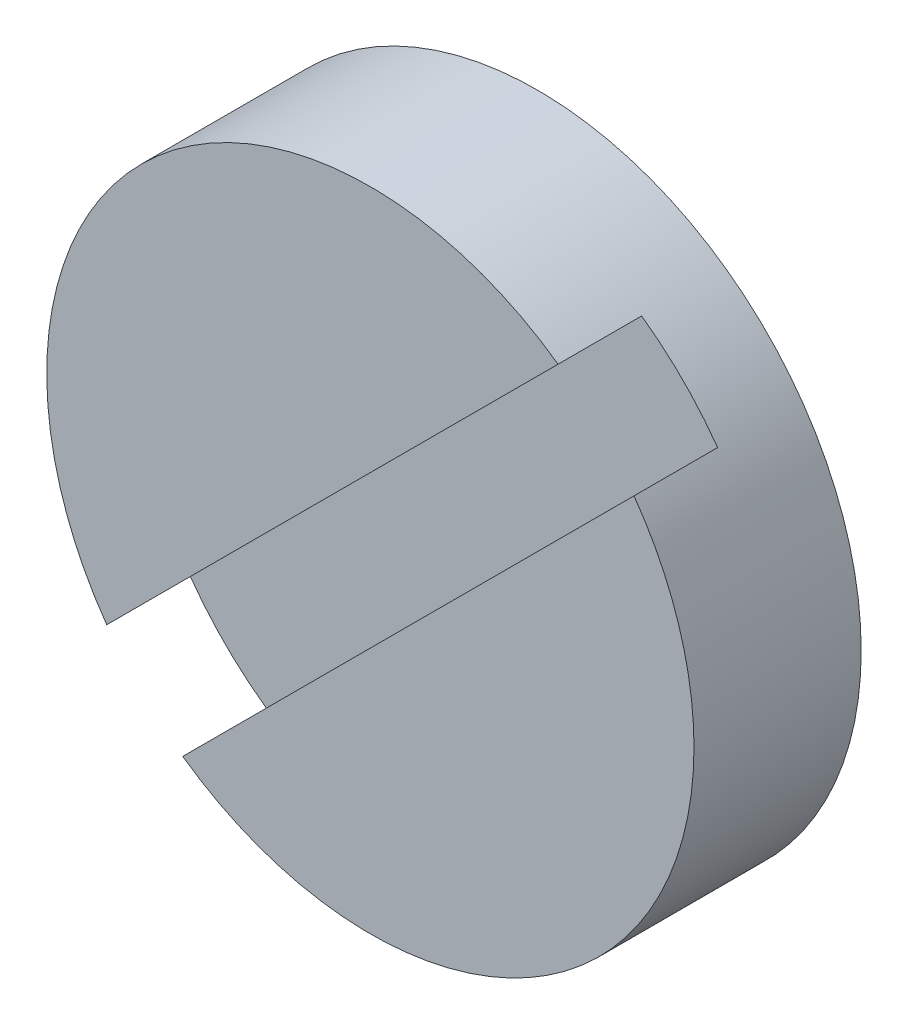
ISO-10303-21;
HEADER;
FILE_DESCRIPTION(('STEP AP214'),'2;1');
FILE_NAME('part.step','',(''),(''),'','','');
FILE_SCHEMA(('AUTOMOTIVE_DESIGN { 1 0 10303 214 1 1 1 1 }'));
ENDSEC;
DATA;
#1=APPLICATION_CONTEXT('core data for automotive mechanical design processes');
#2=APPLICATION_PROTOCOL_DEFINITION('international standard','automotive_design',2000,#1);
#3=PRODUCT_CONTEXT('',#1,'mechanical');
#4=PRODUCT('Part','Part','',(#3));
#5=PRODUCT_RELATED_PRODUCT_CATEGORY('part','',(#4));
#6=PRODUCT_DEFINITION_FORMATION('','',#4);
#7=PRODUCT_DEFINITION_CONTEXT('part definition',#1,'design');
#8=PRODUCT_DEFINITION('design','',#6,#7);
#9=PRODUCT_DEFINITION_SHAPE('','',#8);
#10=(LENGTH_UNIT() NAMED_UNIT(*) SI_UNIT(.MILLI.,.METRE.));
#11=(NAMED_UNIT(*) PLANE_ANGLE_UNIT() SI_UNIT($,.RADIAN.));
#12=(NAMED_UNIT(*) SI_UNIT($,.STERADIAN.) SOLID_ANGLE_UNIT());
#13=UNCERTAINTY_MEASURE_WITH_UNIT(LENGTH_MEASURE(1.E-05),#10,'distance_accuracy_value','');
#14=(GEOMETRIC_REPRESENTATION_CONTEXT(3) GLOBAL_UNCERTAINTY_ASSIGNED_CONTEXT((#13)) GLOBAL_UNIT_ASSIGNED_CONTEXT((#10,
#11,#12)) REPRESENTATION_CONTEXT('',''));
#15=CARTESIAN_POINT('',(0.,0.,0.));
#16=DIRECTION('',(0.,0.,1.));
#17=DIRECTION('',(1.,0.,0.));
#18=AXIS2_PLACEMENT_3D('',#15,#16,#17);
#19=CARTESIAN_POINT('',(8.45887925727502,43.2637793841127,15.6083));
#20=DIRECTION('',(-0.707106781186535,0.70710678118656,0.));
#21=DIRECTION('',(0.,0.,-1.));
#22=AXIS2_PLACEMENT_3D('',#19,#20,#21);
#23=PLANE('',#22);
#24=DIRECTION('',(0.,0.,1.));
#25=VECTOR('',#24,1.);
#26=CARTESIAN_POINT('',(3.17918024418723,37.9840803710251,15.0749));
#27=LINE('',#26,#25);
#28=CARTESIAN_POINT('',(3.17918024418716,37.9840803710251,14.6304));
#29=VERTEX_POINT('',#28);
#30=CARTESIAN_POINT('',(3.17918024418722,37.984080371025,15.5194));
#31=VERTEX_POINT('',#30);
#32=EDGE_CURVE('E79',#29,#31,#27,.T.);
#33=ORIENTED_EDGE('',*,*,#32,.T.);
#34=DIRECTION('',(-0.707106781186549,-0.707106781186547,0.));
#35=VECTOR('',#34,1.);
#36=CARTESIAN_POINT('',(5.57904343195447,40.3839435587922,15.5194));
#37=LINE('',#36,#35);
#38=CARTESIAN_POINT('',(7.9789066197216,42.7838067465593,15.5194));
#39=VERTEX_POINT('',#38);
#40=EDGE_CURVE('E81',#39,#31,#37,.T.);
#41=ORIENTED_EDGE('',*,*,#40,.F.);
#42=DIRECTION('',(0.,0.,-1.));
#43=VECTOR('',#42,1.);
#44=CARTESIAN_POINT('',(7.97890661972157,42.7838067465593,15.0749));
#45=LINE('',#44,#43);
#46=CARTESIAN_POINT('',(7.97890661972156,42.7838067465594,14.6304));
#47=VERTEX_POINT('',#46);
#48=EDGE_CURVE('E82',#39,#47,#45,.T.);
#49=ORIENTED_EDGE('',*,*,#48,.T.);
#50=DIRECTION('',(0.707106781186548,0.707106781186547,0.));
#51=VECTOR('',#50,1.);
#52=CARTESIAN_POINT('',(5.57904343195433,40.3839435587922,14.6304));
#53=LINE('',#52,#51);
#54=EDGE_CURVE('E66',#29,#47,#53,.T.);
#55=ORIENTED_EDGE('',*,*,#54,.F.);
#56=EDGE_LOOP('',(#33,#41,#49,#55));
#57=FACE_BOUND('',#56,.T.);
#58=ADVANCED_FACE('F17',(#57),#23,.T.);
#59=CARTESIAN_POINT('',(5.89766116275868,33.5409716234166,15.5194));
#60=DIRECTION('',(0.,0.,1.));
#61=DIRECTION('',(0.707106781186556,0.707106781186539,0.));
#62=AXIS2_PLACEMENT_3D('',#59,#60,#61);
#63=PLANE('',#62);
#64=ORIENTED_EDGE('',*,*,#40,.T.);
#65=CARTESIAN_POINT('',(5.17493190650629,40.7880550842403,15.5194));
#66=DIRECTION('',(0.,0.,1.));
#67=DIRECTION('',(1.,0.,0.));
#68=AXIS2_PLACEMENT_3D('',#65,#66,#67);
#69=CIRCLE('',#68,3.44170000000006);
#70=EDGE_CURVE('E67',#39,#31,#69,.F.);
#71=ORIENTED_EDGE('',*,*,#70,.F.);
#72=EDGE_LOOP('',(#64,#71));
#73=FACE_BOUND('',#72,.T.);
#74=ADVANCED_FACE('F91',(#73),#63,.T.);
#75=CARTESIAN_POINT('',(5.17493190650629,47.5175943959569,14.6304));
#76=DIRECTION('',(0.,0.,1.));
#77=DIRECTION('',(-0.707106781186547,-0.707106781186548,0.));
#78=AXIS2_PLACEMENT_3D('',#75,#76,#77);
#79=PLANE('',#78);
#80=ORIENTED_EDGE('',*,*,#54,.T.);
#81=CARTESIAN_POINT('',(5.17493190650629,40.7880550842403,14.6304));
#82=DIRECTION('',(0.,0.,1.));
#83=DIRECTION('',(1.,0.,0.));
#84=AXIS2_PLACEMENT_3D('',#81,#82,#83);
#85=CIRCLE('',#84,3.44170000000006);
#86=CARTESIAN_POINT('',(7.17068356882534,43.5920297974556,14.6304));
#87=VERTEX_POINT('',#86);
#88=EDGE_CURVE('E21',#87,#47,#85,.F.);
#89=ORIENTED_EDGE('',*,*,#88,.F.);
#90=DIRECTION('',(0.707106781186543,0.707106781186552,0.));
#91=VECTOR('',#90,1.);
#92=CARTESIAN_POINT('',(4.77082038105818,41.1921666096885,14.6304));
#93=LINE('',#92,#91);
#94=CARTESIAN_POINT('',(2.37095719329099,38.7923034219212,14.6304));
#95=VERTEX_POINT('',#94);
#96=EDGE_CURVE('E63',#95,#87,#93,.T.);
#97=ORIENTED_EDGE('',*,*,#96,.F.);
#98=CARTESIAN_POINT('',(5.17493190650629,40.7880550842403,14.6304));
#99=DIRECTION('',(0.,0.,1.));
#100=DIRECTION('',(1.,0.,0.));
#101=AXIS2_PLACEMENT_3D('',#98,#99,#100);
#102=CIRCLE('',#101,3.44170000000006);
#103=EDGE_CURVE('E56',#29,#95,#102,.F.);
#104=ORIENTED_EDGE('',*,*,#103,.F.);
#105=EDGE_LOOP('',(#80,#89,#97,#104));
#106=FACE_BOUND('',#105,.T.);
#107=ADVANCED_FACE('F62',(#106),#79,.T.);
#108=CARTESIAN_POINT('',(7.65065620637878,44.0720024350091,14.5415));
#109=DIRECTION('',(0.707106781186552,-0.707106781186543,0.));
#110=DIRECTION('',(0.,0.,1.));
#111=AXIS2_PLACEMENT_3D('',#108,#109,#110);
#112=PLANE('',#111);
#113=DIRECTION('',(0.,0.,-1.));
#114=VECTOR('',#113,1.);
#115=CARTESIAN_POINT('',(2.37095719329102,38.7923034219213,15.0749));
#116=LINE('',#115,#114);
#117=CARTESIAN_POINT('',(2.37095719329099,38.7923034219212,15.5194));
#118=VERTEX_POINT('',#117);
#119=EDGE_CURVE('E71',#118,#95,#116,.T.);
#120=ORIENTED_EDGE('',*,*,#119,.T.);
#121=ORIENTED_EDGE('',*,*,#96,.T.);
#122=DIRECTION('',(0.,0.,1.));
#123=VECTOR('',#122,1.);
#124=CARTESIAN_POINT('',(7.17068356882535,43.5920297974557,15.0749));
#125=LINE('',#124,#123);
#126=CARTESIAN_POINT('',(7.17068356882537,43.5920297974556,15.5194));
#127=VERTEX_POINT('',#126);
#128=EDGE_CURVE('E36',#87,#127,#125,.T.);
#129=ORIENTED_EDGE('',*,*,#128,.T.);
#130=DIRECTION('',(0.707106781186548,0.707106781186547,0.));
#131=VECTOR('',#130,1.);
#132=CARTESIAN_POINT('',(4.77082038105826,41.1921666096885,15.5194));
#133=LINE('',#132,#131);
#134=EDGE_CURVE('E74',#118,#127,#133,.T.);
#135=ORIENTED_EDGE('',*,*,#134,.F.);
#136=EDGE_LOOP('',(#120,#121,#129,#135));
#137=FACE_BOUND('',#136,.T.);
#138=ADVANCED_FACE('F73',(#137),#112,.T.);
#139=CARTESIAN_POINT('',(13.3830742572013,40.7880550842403,13.7414));
#140=DIRECTION('',(0.,0.,-1.));
#141=DIRECTION('',(-0.707106781186551,-0.707106781186544,0.));
#142=AXIS2_PLACEMENT_3D('',#139,#140,#141);
#143=PLANE('',#142);
#144=CARTESIAN_POINT('',(5.17493190650629,40.7880550842403,13.7414));
#145=DIRECTION('',(0.,0.,1.));
#146=DIRECTION('',(1.,0.,0.));
#147=AXIS2_PLACEMENT_3D('',#144,#145,#146);
#148=CIRCLE('',#147,3.44170000000006);
#149=CARTESIAN_POINT('',(8.61663190650635,40.7880550842403,13.7414));
#150=VERTEX_POINT('',#149);
#151=EDGE_CURVE('E27',#150,#150,#148,.T.);
#152=ORIENTED_EDGE('',*,*,#151,.F.);
#153=EDGE_LOOP('',(#152));
#154=FACE_BOUND('',#153,.T.);
#155=ADVANCED_FACE('F107',(#154),#143,.T.);
#156=CARTESIAN_POINT('',(4.45220265025393,34.9864301359213,15.5194));
#157=DIRECTION('',(0.,0.,1.));
#158=DIRECTION('',(0.707106781186542,0.707106781186553,0.));
#159=AXIS2_PLACEMENT_3D('',#156,#157,#158);
#160=PLANE('',#159);
#161=ORIENTED_EDGE('',*,*,#134,.T.);
#162=CARTESIAN_POINT('',(5.17493190650629,40.7880550842403,15.5194));
#163=DIRECTION('',(0.,0.,1.));
#164=DIRECTION('',(1.,0.,0.));
#165=AXIS2_PLACEMENT_3D('',#162,#163,#164);
#166=CIRCLE('',#165,3.44170000000006);
#167=EDGE_CURVE('E11',#118,#127,#166,.F.);
#168=ORIENTED_EDGE('',*,*,#167,.F.);
#169=EDGE_LOOP('',(#161,#168));
#170=FACE_BOUND('',#169,.T.);
#171=ADVANCED_FACE('F19',(#170),#160,.T.);
#172=CARTESIAN_POINT('',(5.17493190650629,40.7880550842403,15.5194));
#173=DIRECTION('',(0.,0.,1.));
#174=DIRECTION('',(1.,0.,0.));
#175=AXIS2_PLACEMENT_3D('',#172,#173,#174);
#176=CYLINDRICAL_SURFACE('',#175,3.44170000000006);
#177=ORIENTED_EDGE('',*,*,#128,.F.);
#178=ORIENTED_EDGE('',*,*,#88,.T.);
#179=ORIENTED_EDGE('',*,*,#48,.F.);
#180=ORIENTED_EDGE('',*,*,#70,.T.);
#181=ORIENTED_EDGE('',*,*,#32,.F.);
#182=ORIENTED_EDGE('',*,*,#103,.T.);
#183=ORIENTED_EDGE('',*,*,#119,.F.);
#184=ORIENTED_EDGE('',*,*,#167,.T.);
#185=EDGE_LOOP('',(#177,#178,#179,#180,#181,#182,#183,#184));
#186=FACE_BOUND('',#185,.T.);
#187=ORIENTED_EDGE('',*,*,#151,.T.);
#188=EDGE_LOOP('',(#187));
#189=FACE_BOUND('',#188,.T.);
#190=ADVANCED_FACE('F68',(#186,#189),#176,.T.);
#191=CLOSED_SHELL('',(#58,#74,#107,#138,#155,#171,#190));
#192=MANIFOLD_SOLID_BREP('B1',#191);
#193=ADVANCED_BREP_SHAPE_REPRESENTATION('',(#18,#192),#14);
#194=SHAPE_DEFINITION_REPRESENTATION(#9,#193);
ENDSEC;
END-ISO-10303-21;
